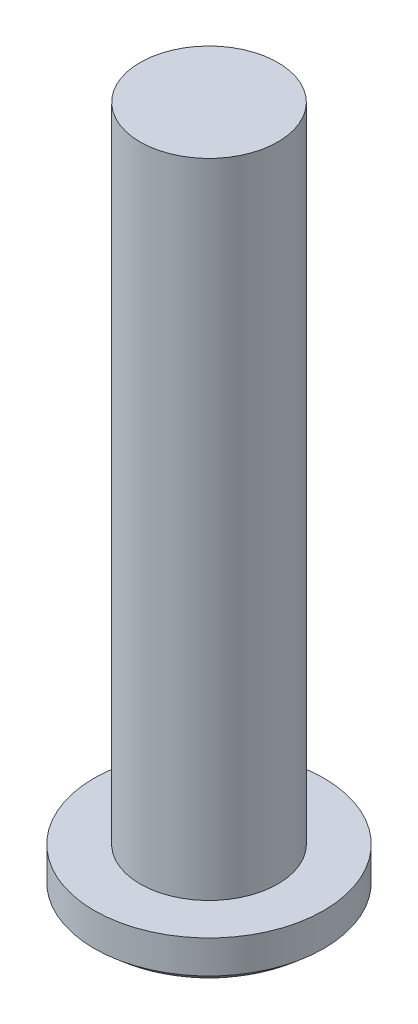
ISO-10303-21;
HEADER;
FILE_DESCRIPTION(('STEP AP214'),'2;1');
FILE_NAME('part.step','',(''),(''),'','','');
FILE_SCHEMA(('AUTOMOTIVE_DESIGN { 1 0 10303 214 1 1 1 1 }'));
ENDSEC;
DATA;
#1=APPLICATION_CONTEXT('core data for automotive mechanical design processes');
#2=APPLICATION_PROTOCOL_DEFINITION('international standard','automotive_design',2000,#1);
#3=PRODUCT_CONTEXT('',#1,'mechanical');
#4=PRODUCT('Part','Part','',(#3));
#5=PRODUCT_RELATED_PRODUCT_CATEGORY('part','',(#4));
#6=PRODUCT_DEFINITION_FORMATION('','',#4);
#7=PRODUCT_DEFINITION_CONTEXT('part definition',#1,'design');
#8=PRODUCT_DEFINITION('design','',#6,#7);
#9=PRODUCT_DEFINITION_SHAPE('','',#8);
#10=(LENGTH_UNIT() NAMED_UNIT(*) SI_UNIT(.MILLI.,.METRE.));
#11=(NAMED_UNIT(*) PLANE_ANGLE_UNIT() SI_UNIT($,.RADIAN.));
#12=(NAMED_UNIT(*) SI_UNIT($,.STERADIAN.) SOLID_ANGLE_UNIT());
#13=UNCERTAINTY_MEASURE_WITH_UNIT(LENGTH_MEASURE(1.E-05),#10,'distance_accuracy_value','');
#14=(GEOMETRIC_REPRESENTATION_CONTEXT(3) GLOBAL_UNCERTAINTY_ASSIGNED_CONTEXT((#13)) GLOBAL_UNIT_ASSIGNED_CONTEXT((#10,
#11,#12)) REPRESENTATION_CONTEXT('',''));
#15=CARTESIAN_POINT('',(0.,0.,0.));
#16=DIRECTION('',(0.,0.,1.));
#17=DIRECTION('',(1.,0.,0.));
#18=AXIS2_PLACEMENT_3D('',#15,#16,#17);
#19=CARTESIAN_POINT('',(0.,3.67271976217093,0.));
#20=DIRECTION('',(0.,1.,0.));
#21=DIRECTION('',(0.,0.,1.));
#22=AXIS2_PLACEMENT_3D('',#19,#20,#21);
#23=SPHERICAL_SURFACE('',#22,3.67271976217093);
#24=CARTESIAN_POINT('',(0.,0.982204857651557,0.));
#25=DIRECTION('',(0.,1.,0.));
#26=DIRECTION('',(0.,0.,1.));
#27=AXIS2_PLACEMENT_3D('',#24,#25,#26);
#28=CIRCLE('',#27,2.5);
#29=CARTESIAN_POINT('',(0.,0.982204857651557,2.5));
#30=VERTEX_POINT('',#29);
#31=EDGE_CURVE('E145',#30,#30,#28,.T.);
#32=ORIENTED_EDGE('',*,*,#31,.F.);
#33=EDGE_LOOP('',(#32));
#34=FACE_BOUND('',#33,.T.);
#35=CARTESIAN_POINT('',(0.,3.67271976217093,-0.2));
#36=DIRECTION('',(0.,0.,1.));
#37=DIRECTION('',(1.,0.,0.));
#38=AXIS2_PLACEMENT_3D('',#35,#36,#37);
#39=CIRCLE('',#38,3.6672701634105);
#40=CARTESIAN_POINT('',(-0.2,0.0109073077378943,-0.2));
#41=VERTEX_POINT('',#40);
#42=CARTESIAN_POINT('',(-1.,0.144424075661522,-0.2));
#43=VERTEX_POINT('',#42);
#44=EDGE_CURVE('E128',#41,#43,#39,.F.);
#45=ORIENTED_EDGE('',*,*,#44,.T.);
#46=CARTESIAN_POINT('',(-1.,3.67271976217093,0.));
#47=DIRECTION('',(1.,0.,0.));
#48=DIRECTION('',(0.,0.,-1.));
#49=AXIS2_PLACEMENT_3D('',#46,#47,#48);
#50=CIRCLE('',#49,3.53395959957678);
#51=CARTESIAN_POINT('',(-1.,0.144424075661522,0.2));
#52=VERTEX_POINT('',#51);
#53=EDGE_CURVE('E12',#43,#52,#50,.F.);
#54=ORIENTED_EDGE('',*,*,#53,.T.);
#55=CARTESIAN_POINT('',(0.,3.67271976217093,0.2));
#56=DIRECTION('',(0.,0.,-1.));
#57=DIRECTION('',(-1.,0.,0.));
#58=AXIS2_PLACEMENT_3D('',#55,#56,#57);
#59=CIRCLE('',#58,3.6672701634105);
#60=CARTESIAN_POINT('',(-0.2,0.0109073077378943,0.2));
#61=VERTEX_POINT('',#60);
#62=EDGE_CURVE('E43',#52,#61,#59,.F.);
#63=ORIENTED_EDGE('',*,*,#62,.T.);
#64=CARTESIAN_POINT('',(-0.2,3.67271976217093,0.));
#65=DIRECTION('',(1.,0.,0.));
#66=DIRECTION('',(0.,0.,-1.));
#67=AXIS2_PLACEMENT_3D('',#64,#65,#66);
#68=CIRCLE('',#67,3.6672701634105);
#69=CARTESIAN_POINT('',(-0.2,0.144424075661522,1.));
#70=VERTEX_POINT('',#69);
#71=EDGE_CURVE('E237',#61,#70,#68,.F.);
#72=ORIENTED_EDGE('',*,*,#71,.T.);
#73=CARTESIAN_POINT('',(0.,3.67271976217093,1.));
#74=DIRECTION('',(0.,0.,-1.));
#75=DIRECTION('',(-1.,0.,0.));
#76=AXIS2_PLACEMENT_3D('',#73,#74,#75);
#77=CIRCLE('',#76,3.53395959957678);
#78=CARTESIAN_POINT('',(0.2,0.144424075661522,1.));
#79=VERTEX_POINT('',#78);
#80=EDGE_CURVE('E234',#70,#79,#77,.F.);
#81=ORIENTED_EDGE('',*,*,#80,.T.);
#82=CARTESIAN_POINT('',(0.2,3.67271976217093,0.));
#83=DIRECTION('',(-1.,0.,0.));
#84=DIRECTION('',(0.,0.,1.));
#85=AXIS2_PLACEMENT_3D('',#82,#83,#84);
#86=CIRCLE('',#85,3.6672701634105);
#87=CARTESIAN_POINT('',(0.2,0.0109073077378943,0.2));
#88=VERTEX_POINT('',#87);
#89=EDGE_CURVE('E231',#79,#88,#86,.F.);
#90=ORIENTED_EDGE('',*,*,#89,.T.);
#91=CARTESIAN_POINT('',(0.,3.67271976217093,0.2));
#92=DIRECTION('',(0.,0.,-1.));
#93=DIRECTION('',(-1.,0.,0.));
#94=AXIS2_PLACEMENT_3D('',#91,#92,#93);
#95=CIRCLE('',#94,3.6672701634105);
#96=CARTESIAN_POINT('',(1.,0.144424075661522,0.2));
#97=VERTEX_POINT('',#96);
#98=EDGE_CURVE('E228',#88,#97,#95,.F.);
#99=ORIENTED_EDGE('',*,*,#98,.T.);
#100=CARTESIAN_POINT('',(1.,3.67271976217093,0.));
#101=DIRECTION('',(-1.,0.,0.));
#102=DIRECTION('',(0.,0.,1.));
#103=AXIS2_PLACEMENT_3D('',#100,#101,#102);
#104=CIRCLE('',#103,3.53395959957678);
#105=CARTESIAN_POINT('',(1.,0.144424075661522,-0.2));
#106=VERTEX_POINT('',#105);
#107=EDGE_CURVE('E225',#97,#106,#104,.F.);
#108=ORIENTED_EDGE('',*,*,#107,.T.);
#109=CARTESIAN_POINT('',(0.,3.67271976217093,-0.2));
#110=DIRECTION('',(0.,0.,1.));
#111=DIRECTION('',(1.,0.,0.));
#112=AXIS2_PLACEMENT_3D('',#109,#110,#111);
#113=CIRCLE('',#112,3.6672701634105);
#114=CARTESIAN_POINT('',(0.2,0.0109073077378943,-0.2));
#115=VERTEX_POINT('',#114);
#116=EDGE_CURVE('E222',#106,#115,#113,.F.);
#117=ORIENTED_EDGE('',*,*,#116,.T.);
#118=CARTESIAN_POINT('',(0.2,3.67271976217093,0.));
#119=DIRECTION('',(-1.,0.,0.));
#120=DIRECTION('',(0.,0.,1.));
#121=AXIS2_PLACEMENT_3D('',#118,#119,#120);
#122=CIRCLE('',#121,3.6672701634105);
#123=CARTESIAN_POINT('',(0.2,0.144424075661522,-1.));
#124=VERTEX_POINT('',#123);
#125=EDGE_CURVE('E219',#115,#124,#122,.F.);
#126=ORIENTED_EDGE('',*,*,#125,.T.);
#127=CARTESIAN_POINT('',(0.,3.67271976217093,-1.));
#128=DIRECTION('',(0.,0.,1.));
#129=DIRECTION('',(1.,0.,0.));
#130=AXIS2_PLACEMENT_3D('',#127,#128,#129);
#131=CIRCLE('',#130,3.53395959957678);
#132=CARTESIAN_POINT('',(-0.2,0.144424075661522,-1.));
#133=VERTEX_POINT('',#132);
#134=EDGE_CURVE('E216',#124,#133,#131,.F.);
#135=ORIENTED_EDGE('',*,*,#134,.T.);
#136=CARTESIAN_POINT('',(-0.2,3.67271976217093,0.));
#137=DIRECTION('',(1.,0.,0.));
#138=DIRECTION('',(0.,0.,-1.));
#139=AXIS2_PLACEMENT_3D('',#136,#137,#138);
#140=CIRCLE('',#139,3.6672701634105);
#141=EDGE_CURVE('E214',#133,#41,#140,.F.);
#142=ORIENTED_EDGE('',*,*,#141,.T.);
#143=EDGE_LOOP('',(#45,#54,#63,#72,#81,#90,#99,#108,#117,#126,#135,#142));
#144=FACE_BOUND('',#143,.T.);
#145=ADVANCED_FACE('F35',(#34,#144),#23,.T.);
#146=CARTESIAN_POINT('',(0.,1.7,0.));
#147=DIRECTION('',(0.,-1.,0.));
#148=DIRECTION('',(0.,0.,-1.));
#149=AXIS2_PLACEMENT_3D('',#146,#147,#148);
#150=CYLINDRICAL_SURFACE('',#149,2.5);
#151=ORIENTED_EDGE('',*,*,#31,.T.);
#152=EDGE_LOOP('',(#151));
#153=FACE_BOUND('',#152,.T.);
#154=CARTESIAN_POINT('',(0.,1.7,0.));
#155=DIRECTION('',(0.,1.,0.));
#156=DIRECTION('',(0.,0.,1.));
#157=AXIS2_PLACEMENT_3D('',#154,#155,#156);
#158=CIRCLE('',#157,2.5);
#159=CARTESIAN_POINT('',(0.,1.7,2.5));
#160=VERTEX_POINT('',#159);
#161=EDGE_CURVE('E207',#160,#160,#158,.T.);
#162=ORIENTED_EDGE('',*,*,#161,.F.);
#163=EDGE_LOOP('',(#162));
#164=FACE_BOUND('',#163,.T.);
#165=ADVANCED_FACE('F37',(#153,#164),#150,.T.);
#166=CARTESIAN_POINT('',(0.,1.7,0.));
#167=DIRECTION('',(0.,1.,0.));
#168=DIRECTION('',(0.,0.,1.));
#169=AXIS2_PLACEMENT_3D('',#166,#167,#168);
#170=PLANE('',#169);
#171=CARTESIAN_POINT('',(0.,1.7,0.));
#172=DIRECTION('',(0.,1.,0.));
#173=DIRECTION('',(0.,0.,1.));
#174=AXIS2_PLACEMENT_3D('',#171,#172,#173);
#175=CIRCLE('',#174,1.5);
#176=CARTESIAN_POINT('',(0.,1.7,1.5));
#177=VERTEX_POINT('',#176);
#178=EDGE_CURVE('E208',#177,#177,#175,.T.);
#179=ORIENTED_EDGE('',*,*,#178,.F.);
#180=EDGE_LOOP('',(#179));
#181=FACE_BOUND('',#180,.T.);
#182=ORIENTED_EDGE('',*,*,#161,.T.);
#183=EDGE_LOOP('',(#182));
#184=FACE_BOUND('',#183,.T.);
#185=ADVANCED_FACE('F281',(#181,#184),#170,.T.);
#186=CARTESIAN_POINT('',(0.,15.7,0.));
#187=DIRECTION('',(0.,-1.,0.));
#188=DIRECTION('',(0.,0.,-1.));
#189=AXIS2_PLACEMENT_3D('',#186,#187,#188);
#190=CYLINDRICAL_SURFACE('',#189,1.5);
#191=CARTESIAN_POINT('',(0.,15.7,0.));
#192=DIRECTION('',(0.,1.,0.));
#193=DIRECTION('',(0.,0.,1.));
#194=AXIS2_PLACEMENT_3D('',#191,#192,#193);
#195=CIRCLE('',#194,1.5);
#196=CARTESIAN_POINT('',(0.,15.7,1.5));
#197=VERTEX_POINT('',#196);
#198=EDGE_CURVE('E149',#197,#197,#195,.T.);
#199=ORIENTED_EDGE('',*,*,#198,.F.);
#200=EDGE_LOOP('',(#199));
#201=FACE_BOUND('',#200,.T.);
#202=ORIENTED_EDGE('',*,*,#178,.T.);
#203=EDGE_LOOP('',(#202));
#204=FACE_BOUND('',#203,.T.);
#205=ADVANCED_FACE('F290',(#201,#204),#190,.T.);
#206=CARTESIAN_POINT('',(0.,15.7,0.));
#207=DIRECTION('',(0.,1.,0.));
#208=DIRECTION('',(0.,0.,1.));
#209=AXIS2_PLACEMENT_3D('',#206,#207,#208);
#210=PLANE('',#209);
#211=ORIENTED_EDGE('',*,*,#198,.T.);
#212=EDGE_LOOP('',(#211));
#213=FACE_BOUND('',#212,.T.);
#214=ADVANCED_FACE('F287',(#213),#210,.T.);
#215=CARTESIAN_POINT('',(-1.,4.52842712474619,0.2));
#216=DIRECTION('',(1.,0.,0.));
#217=DIRECTION('',(0.,0.,-1.));
#218=AXIS2_PLACEMENT_3D('',#215,#216,#217);
#219=PLANE('',#218);
#220=DIRECTION('',(0.,-1.,0.));
#221=VECTOR('',#220,1.);
#222=CARTESIAN_POINT('',(-1.,4.52842712474619,-0.2));
#223=LINE('',#222,#221);
#224=CARTESIAN_POINT('',(-1.,1.1,-0.2));
#225=VERTEX_POINT('',#224);
#226=EDGE_CURVE('E50',#225,#43,#223,.T.);
#227=ORIENTED_EDGE('',*,*,#226,.F.);
#228=DIRECTION('',(0.,0.,1.));
#229=VECTOR('',#228,1.);
#230=CARTESIAN_POINT('',(-1.,1.1,0.2));
#231=LINE('',#230,#229);
#232=CARTESIAN_POINT('',(-1.,1.1,0.2));
#233=VERTEX_POINT('',#232);
#234=EDGE_CURVE('E140',#225,#233,#231,.T.);
#235=ORIENTED_EDGE('',*,*,#234,.T.);
#236=DIRECTION('',(0.,-1.,0.));
#237=VECTOR('',#236,1.);
#238=CARTESIAN_POINT('',(-1.,4.52842712474619,0.2));
#239=LINE('',#238,#237);
#240=EDGE_CURVE('E178',#233,#52,#239,.T.);
#241=ORIENTED_EDGE('',*,*,#240,.T.);
#242=ORIENTED_EDGE('',*,*,#53,.F.);
#243=EDGE_LOOP('',(#227,#235,#241,#242));
#244=FACE_BOUND('',#243,.T.);
#245=ADVANCED_FACE('F241',(#244),#219,.T.);
#246=CARTESIAN_POINT('',(-1.,4.52842712474619,0.2));
#247=DIRECTION('',(0.,0.,-1.));
#248=DIRECTION('',(-1.,0.,0.));
#249=AXIS2_PLACEMENT_3D('',#246,#247,#248);
#250=PLANE('',#249);
#251=ORIENTED_EDGE('',*,*,#240,.F.);
#252=DIRECTION('',(1.,0.,0.));
#253=VECTOR('',#252,1.);
#254=CARTESIAN_POINT('',(-1.,1.1,0.2));
#255=LINE('',#254,#253);
#256=CARTESIAN_POINT('',(-0.2,1.1,0.2));
#257=VERTEX_POINT('',#256);
#258=EDGE_CURVE('E174',#233,#257,#255,.T.);
#259=ORIENTED_EDGE('',*,*,#258,.T.);
#260=DIRECTION('',(0.,-1.,0.));
#261=VECTOR('',#260,1.);
#262=CARTESIAN_POINT('',(-0.2,4.52842712474619,0.2));
#263=LINE('',#262,#261);
#264=EDGE_CURVE('E180',#257,#61,#263,.T.);
#265=ORIENTED_EDGE('',*,*,#264,.T.);
#266=ORIENTED_EDGE('',*,*,#62,.F.);
#267=EDGE_LOOP('',(#251,#259,#265,#266));
#268=FACE_BOUND('',#267,.T.);
#269=ADVANCED_FACE('F242',(#268),#250,.T.);
#270=CARTESIAN_POINT('',(-0.2,4.52842712474619,1.));
#271=DIRECTION('',(1.,0.,0.));
#272=DIRECTION('',(0.,0.,-1.));
#273=AXIS2_PLACEMENT_3D('',#270,#271,#272);
#274=PLANE('',#273);
#275=ORIENTED_EDGE('',*,*,#264,.F.);
#276=DIRECTION('',(0.,0.,1.));
#277=VECTOR('',#276,1.);
#278=CARTESIAN_POINT('',(-0.2,1.1,1.));
#279=LINE('',#278,#277);
#280=CARTESIAN_POINT('',(-0.2,1.1,1.));
#281=VERTEX_POINT('',#280);
#282=EDGE_CURVE('E171',#257,#281,#279,.T.);
#283=ORIENTED_EDGE('',*,*,#282,.T.);
#284=DIRECTION('',(0.,-1.,0.));
#285=VECTOR('',#284,1.);
#286=CARTESIAN_POINT('',(-0.2,4.52842712474619,1.));
#287=LINE('',#286,#285);
#288=EDGE_CURVE('E182',#281,#70,#287,.T.);
#289=ORIENTED_EDGE('',*,*,#288,.T.);
#290=ORIENTED_EDGE('',*,*,#71,.F.);
#291=EDGE_LOOP('',(#275,#283,#289,#290));
#292=FACE_BOUND('',#291,.T.);
#293=ADVANCED_FACE('F246',(#292),#274,.T.);
#294=CARTESIAN_POINT('',(0.2,4.52842712474619,1.));
#295=DIRECTION('',(0.,0.,-1.));
#296=DIRECTION('',(-1.,0.,0.));
#297=AXIS2_PLACEMENT_3D('',#294,#295,#296);
#298=PLANE('',#297);
#299=ORIENTED_EDGE('',*,*,#288,.F.);
#300=DIRECTION('',(1.,0.,0.));
#301=VECTOR('',#300,1.);
#302=CARTESIAN_POINT('',(0.2,1.1,1.));
#303=LINE('',#302,#301);
#304=CARTESIAN_POINT('',(0.2,1.1,1.));
#305=VERTEX_POINT('',#304);
#306=EDGE_CURVE('E168',#281,#305,#303,.T.);
#307=ORIENTED_EDGE('',*,*,#306,.T.);
#308=DIRECTION('',(0.,-1.,0.));
#309=VECTOR('',#308,1.);
#310=CARTESIAN_POINT('',(0.2,4.52842712474619,1.));
#311=LINE('',#310,#309);
#312=EDGE_CURVE('E185',#305,#79,#311,.T.);
#313=ORIENTED_EDGE('',*,*,#312,.T.);
#314=ORIENTED_EDGE('',*,*,#80,.F.);
#315=EDGE_LOOP('',(#299,#307,#313,#314));
#316=FACE_BOUND('',#315,.T.);
#317=ADVANCED_FACE('F248',(#316),#298,.T.);
#318=CARTESIAN_POINT('',(0.2,4.52842712474619,1.));
#319=DIRECTION('',(-1.,0.,0.));
#320=DIRECTION('',(0.,0.,1.));
#321=AXIS2_PLACEMENT_3D('',#318,#319,#320);
#322=PLANE('',#321);
#323=ORIENTED_EDGE('',*,*,#312,.F.);
#324=DIRECTION('',(0.,0.,-1.));
#325=VECTOR('',#324,1.);
#326=CARTESIAN_POINT('',(0.2,1.1,1.));
#327=LINE('',#326,#325);
#328=CARTESIAN_POINT('',(0.2,1.1,0.2));
#329=VERTEX_POINT('',#328);
#330=EDGE_CURVE('E165',#305,#329,#327,.T.);
#331=ORIENTED_EDGE('',*,*,#330,.T.);
#332=DIRECTION('',(0.,-1.,0.));
#333=VECTOR('',#332,1.);
#334=CARTESIAN_POINT('',(0.2,4.52842712474619,0.2));
#335=LINE('',#334,#333);
#336=EDGE_CURVE('E188',#329,#88,#335,.T.);
#337=ORIENTED_EDGE('',*,*,#336,.T.);
#338=ORIENTED_EDGE('',*,*,#89,.F.);
#339=EDGE_LOOP('',(#323,#331,#337,#338));
#340=FACE_BOUND('',#339,.T.);
#341=ADVANCED_FACE('F251',(#340),#322,.T.);
#342=CARTESIAN_POINT('',(0.2,4.52842712474619,0.2));
#343=DIRECTION('',(0.,0.,-1.));
#344=DIRECTION('',(-1.,0.,0.));
#345=AXIS2_PLACEMENT_3D('',#342,#343,#344);
#346=PLANE('',#345);
#347=ORIENTED_EDGE('',*,*,#336,.F.);
#348=DIRECTION('',(1.,0.,0.));
#349=VECTOR('',#348,1.);
#350=CARTESIAN_POINT('',(0.2,1.1,0.2));
#351=LINE('',#350,#349);
#352=CARTESIAN_POINT('',(1.,1.1,0.2));
#353=VERTEX_POINT('',#352);
#354=EDGE_CURVE('E162',#329,#353,#351,.T.);
#355=ORIENTED_EDGE('',*,*,#354,.T.);
#356=DIRECTION('',(0.,-1.,0.));
#357=VECTOR('',#356,1.);
#358=CARTESIAN_POINT('',(1.,4.52842712474619,0.2));
#359=LINE('',#358,#357);
#360=EDGE_CURVE('E191',#353,#97,#359,.T.);
#361=ORIENTED_EDGE('',*,*,#360,.T.);
#362=ORIENTED_EDGE('',*,*,#98,.F.);
#363=EDGE_LOOP('',(#347,#355,#361,#362));
#364=FACE_BOUND('',#363,.T.);
#365=ADVANCED_FACE('F254',(#364),#346,.T.);
#366=CARTESIAN_POINT('',(1.,4.52842712474619,0.2));
#367=DIRECTION('',(-1.,0.,0.));
#368=DIRECTION('',(0.,0.,1.));
#369=AXIS2_PLACEMENT_3D('',#366,#367,#368);
#370=PLANE('',#369);
#371=ORIENTED_EDGE('',*,*,#360,.F.);
#372=DIRECTION('',(0.,0.,-1.));
#373=VECTOR('',#372,1.);
#374=CARTESIAN_POINT('',(1.,1.1,0.2));
#375=LINE('',#374,#373);
#376=CARTESIAN_POINT('',(1.,1.1,-0.2));
#377=VERTEX_POINT('',#376);
#378=EDGE_CURVE('E159',#353,#377,#375,.T.);
#379=ORIENTED_EDGE('',*,*,#378,.T.);
#380=DIRECTION('',(0.,-1.,0.));
#381=VECTOR('',#380,1.);
#382=CARTESIAN_POINT('',(1.,4.52842712474619,-0.2));
#383=LINE('',#382,#381);
#384=EDGE_CURVE('E194',#377,#106,#383,.T.);
#385=ORIENTED_EDGE('',*,*,#384,.T.);
#386=ORIENTED_EDGE('',*,*,#107,.F.);
#387=EDGE_LOOP('',(#371,#379,#385,#386));
#388=FACE_BOUND('',#387,.T.);
#389=ADVANCED_FACE('F257',(#388),#370,.T.);
#390=CARTESIAN_POINT('',(0.2,4.52842712474619,-0.2));
#391=DIRECTION('',(0.,0.,1.));
#392=DIRECTION('',(1.,0.,0.));
#393=AXIS2_PLACEMENT_3D('',#390,#391,#392);
#394=PLANE('',#393);
#395=ORIENTED_EDGE('',*,*,#384,.F.);
#396=DIRECTION('',(-1.,0.,0.));
#397=VECTOR('',#396,1.);
#398=CARTESIAN_POINT('',(0.2,1.1,-0.2));
#399=LINE('',#398,#397);
#400=CARTESIAN_POINT('',(0.2,1.1,-0.2));
#401=VERTEX_POINT('',#400);
#402=EDGE_CURVE('E156',#377,#401,#399,.T.);
#403=ORIENTED_EDGE('',*,*,#402,.T.);
#404=DIRECTION('',(0.,-1.,0.));
#405=VECTOR('',#404,1.);
#406=CARTESIAN_POINT('',(0.2,4.52842712474619,-0.2));
#407=LINE('',#406,#405);
#408=EDGE_CURVE('E197',#401,#115,#407,.T.);
#409=ORIENTED_EDGE('',*,*,#408,.T.);
#410=ORIENTED_EDGE('',*,*,#116,.F.);
#411=EDGE_LOOP('',(#395,#403,#409,#410));
#412=FACE_BOUND('',#411,.T.);
#413=ADVANCED_FACE('F260',(#412),#394,.T.);
#414=CARTESIAN_POINT('',(0.2,4.52842712474619,-0.2));
#415=DIRECTION('',(-1.,0.,0.));
#416=DIRECTION('',(0.,0.,1.));
#417=AXIS2_PLACEMENT_3D('',#414,#415,#416);
#418=PLANE('',#417);
#419=ORIENTED_EDGE('',*,*,#408,.F.);
#420=DIRECTION('',(0.,0.,-1.));
#421=VECTOR('',#420,1.);
#422=CARTESIAN_POINT('',(0.2,1.1,-0.2));
#423=LINE('',#422,#421);
#424=CARTESIAN_POINT('',(0.2,1.1,-1.));
#425=VERTEX_POINT('',#424);
#426=EDGE_CURVE('E151',#401,#425,#423,.T.);
#427=ORIENTED_EDGE('',*,*,#426,.T.);
#428=DIRECTION('',(0.,-1.,0.));
#429=VECTOR('',#428,1.);
#430=CARTESIAN_POINT('',(0.2,4.52842712474619,-1.));
#431=LINE('',#430,#429);
#432=EDGE_CURVE('E200',#425,#124,#431,.T.);
#433=ORIENTED_EDGE('',*,*,#432,.T.);
#434=ORIENTED_EDGE('',*,*,#125,.F.);
#435=EDGE_LOOP('',(#419,#427,#433,#434));
#436=FACE_BOUND('',#435,.T.);
#437=ADVANCED_FACE('F263',(#436),#418,.T.);
#438=CARTESIAN_POINT('',(0.2,4.52842712474619,-1.));
#439=DIRECTION('',(0.,0.,1.));
#440=DIRECTION('',(1.,0.,0.));
#441=AXIS2_PLACEMENT_3D('',#438,#439,#440);
#442=PLANE('',#441);
#443=ORIENTED_EDGE('',*,*,#432,.F.);
#444=DIRECTION('',(-1.,0.,0.));
#445=VECTOR('',#444,1.);
#446=CARTESIAN_POINT('',(0.2,1.1,-1.));
#447=LINE('',#446,#445);
#448=CARTESIAN_POINT('',(-0.2,1.1,-1.));
#449=VERTEX_POINT('',#448);
#450=EDGE_CURVE('E146',#425,#449,#447,.T.);
#451=ORIENTED_EDGE('',*,*,#450,.T.);
#452=DIRECTION('',(0.,-1.,0.));
#453=VECTOR('',#452,1.);
#454=CARTESIAN_POINT('',(-0.2,4.52842712474619,-1.));
#455=LINE('',#454,#453);
#456=EDGE_CURVE('E132',#449,#133,#455,.T.);
#457=ORIENTED_EDGE('',*,*,#456,.T.);
#458=ORIENTED_EDGE('',*,*,#134,.F.);
#459=EDGE_LOOP('',(#443,#451,#457,#458));
#460=FACE_BOUND('',#459,.T.);
#461=ADVANCED_FACE('F266',(#460),#442,.T.);
#462=CARTESIAN_POINT('',(-0.2,4.52842712474619,-0.2));
#463=DIRECTION('',(1.,0.,0.));
#464=DIRECTION('',(0.,0.,-1.));
#465=AXIS2_PLACEMENT_3D('',#462,#463,#464);
#466=PLANE('',#465);
#467=ORIENTED_EDGE('',*,*,#456,.F.);
#468=DIRECTION('',(0.,0.,1.));
#469=VECTOR('',#468,1.);
#470=CARTESIAN_POINT('',(-0.2,1.1,-0.2));
#471=LINE('',#470,#469);
#472=CARTESIAN_POINT('',(-0.2,1.1,-0.2));
#473=VERTEX_POINT('',#472);
#474=EDGE_CURVE('E137',#449,#473,#471,.T.);
#475=ORIENTED_EDGE('',*,*,#474,.T.);
#476=DIRECTION('',(0.,-1.,0.));
#477=VECTOR('',#476,1.);
#478=CARTESIAN_POINT('',(-0.2,4.52842712474619,-0.2));
#479=LINE('',#478,#477);
#480=EDGE_CURVE('E123',#473,#41,#479,.T.);
#481=ORIENTED_EDGE('',*,*,#480,.T.);
#482=ORIENTED_EDGE('',*,*,#141,.F.);
#483=EDGE_LOOP('',(#467,#475,#481,#482));
#484=FACE_BOUND('',#483,.T.);
#485=ADVANCED_FACE('F142',(#484),#466,.T.);
#486=CARTESIAN_POINT('',(-1.,4.52842712474619,-0.2));
#487=DIRECTION('',(0.,0.,1.));
#488=DIRECTION('',(1.,0.,0.));
#489=AXIS2_PLACEMENT_3D('',#486,#487,#488);
#490=PLANE('',#489);
#491=ORIENTED_EDGE('',*,*,#480,.F.);
#492=DIRECTION('',(-1.,0.,0.));
#493=VECTOR('',#492,1.);
#494=CARTESIAN_POINT('',(-1.,1.1,-0.2));
#495=LINE('',#494,#493);
#496=EDGE_CURVE('E126',#473,#225,#495,.T.);
#497=ORIENTED_EDGE('',*,*,#496,.T.);
#498=ORIENTED_EDGE('',*,*,#226,.T.);
#499=ORIENTED_EDGE('',*,*,#44,.F.);
#500=EDGE_LOOP('',(#491,#497,#498,#499));
#501=FACE_BOUND('',#500,.T.);
#502=ADVANCED_FACE('F125',(#501),#490,.T.);
#503=CARTESIAN_POINT('',(0.,1.1,0.));
#504=DIRECTION('',(0.,1.,0.));
#505=DIRECTION('',(0.,0.,1.));
#506=AXIS2_PLACEMENT_3D('',#503,#504,#505);
#507=PLANE('',#506);
#508=ORIENTED_EDGE('',*,*,#496,.F.);
#509=ORIENTED_EDGE('',*,*,#474,.F.);
#510=ORIENTED_EDGE('',*,*,#450,.F.);
#511=ORIENTED_EDGE('',*,*,#426,.F.);
#512=ORIENTED_EDGE('',*,*,#402,.F.);
#513=ORIENTED_EDGE('',*,*,#378,.F.);
#514=ORIENTED_EDGE('',*,*,#354,.F.);
#515=ORIENTED_EDGE('',*,*,#330,.F.);
#516=ORIENTED_EDGE('',*,*,#306,.F.);
#517=ORIENTED_EDGE('',*,*,#282,.F.);
#518=ORIENTED_EDGE('',*,*,#258,.F.);
#519=ORIENTED_EDGE('',*,*,#234,.F.);
#520=EDGE_LOOP('',(#508,#509,#510,#511,#512,#513,#514,#515,#516,#517,#518,#519));
#521=FACE_BOUND('',#520,.T.);
#522=ADVANCED_FACE('F136',(#521),#507,.F.);
#523=CLOSED_SHELL('',(#145,#165,#185,#205,#214,#245,#269,#293,#317,#341,#365,#389,#413,#437,
#461,#485,#502,#522));
#524=MANIFOLD_SOLID_BREP('B2',#523);
#525=ADVANCED_BREP_SHAPE_REPRESENTATION('',(#18,#524),#14);
#526=SHAPE_DEFINITION_REPRESENTATION(#9,#525);
ENDSEC;
END-ISO-10303-21;
